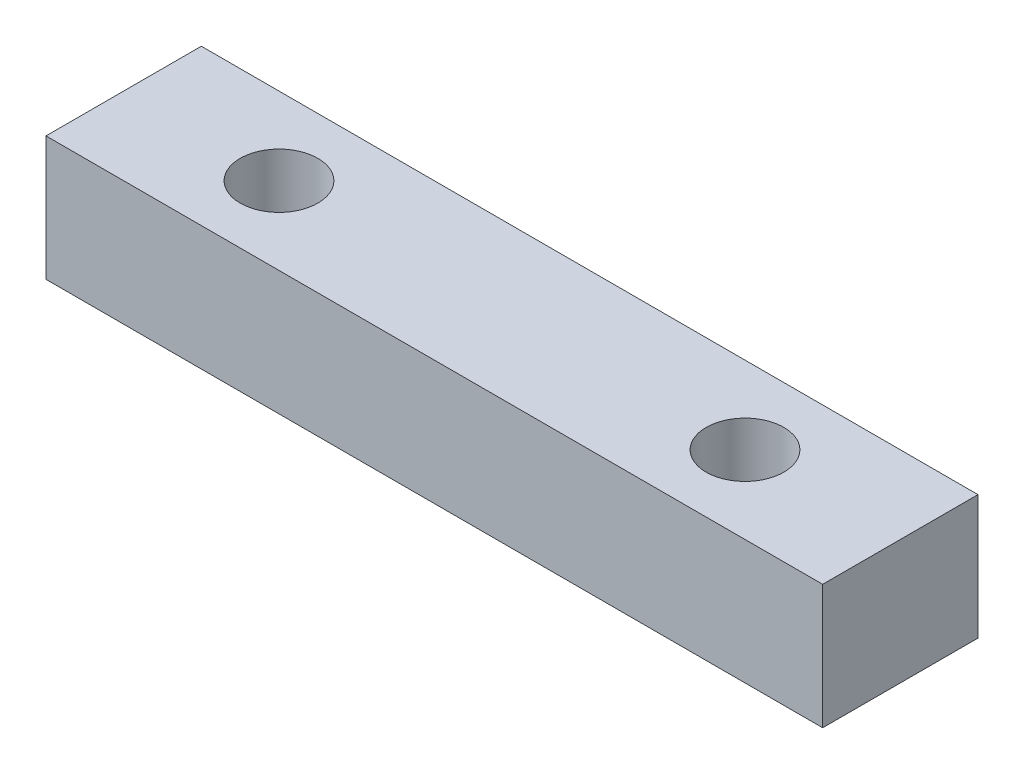
ISO-10303-21;
HEADER;
FILE_DESCRIPTION(('STEP AP214'),'2;1');
FILE_NAME('part.step','',(''),(''),'','','');
FILE_SCHEMA(('AUTOMOTIVE_DESIGN { 1 0 10303 214 1 1 1 1 }'));
ENDSEC;
DATA;
#1=APPLICATION_CONTEXT('core data for automotive mechanical design processes');
#2=APPLICATION_PROTOCOL_DEFINITION('international standard','automotive_design',2000,#1);
#3=PRODUCT_CONTEXT('',#1,'mechanical');
#4=PRODUCT('Part','Part','',(#3));
#5=PRODUCT_RELATED_PRODUCT_CATEGORY('part','',(#4));
#6=PRODUCT_DEFINITION_FORMATION('','',#4);
#7=PRODUCT_DEFINITION_CONTEXT('part definition',#1,'design');
#8=PRODUCT_DEFINITION('design','',#6,#7);
#9=PRODUCT_DEFINITION_SHAPE('','',#8);
#10=(LENGTH_UNIT() NAMED_UNIT(*) SI_UNIT(.MILLI.,.METRE.));
#11=(NAMED_UNIT(*) PLANE_ANGLE_UNIT() SI_UNIT($,.RADIAN.));
#12=(NAMED_UNIT(*) SI_UNIT($,.STERADIAN.) SOLID_ANGLE_UNIT());
#13=UNCERTAINTY_MEASURE_WITH_UNIT(LENGTH_MEASURE(1.E-05),#10,'distance_accuracy_value','');
#14=(GEOMETRIC_REPRESENTATION_CONTEXT(3) GLOBAL_UNCERTAINTY_ASSIGNED_CONTEXT((#13)) GLOBAL_UNIT_ASSIGNED_CONTEXT((#10,
#11,#12)) REPRESENTATION_CONTEXT('',''));
#15=CARTESIAN_POINT('',(0.,0.,0.));
#16=DIRECTION('',(0.,0.,1.));
#17=DIRECTION('',(1.,0.,0.));
#18=AXIS2_PLACEMENT_3D('',#15,#16,#17);
#19=CARTESIAN_POINT('',(0.,4.,0.));
#20=DIRECTION('',(0.,-1.,0.));
#21=DIRECTION('',(0.,0.,-1.));
#22=AXIS2_PLACEMENT_3D('',#19,#20,#21);
#23=PLANE('',#22);
#24=DIRECTION('',(0.,0.,-1.));
#25=VECTOR('',#24,1.);
#26=CARTESIAN_POINT('',(12.5,4.,-2.5));
#27=LINE('',#26,#25);
#28=CARTESIAN_POINT('',(12.5,4.,2.5));
#29=VERTEX_POINT('',#28);
#30=CARTESIAN_POINT('',(12.5,4.,-2.5));
#31=VERTEX_POINT('',#30);
#32=EDGE_CURVE('E85',#29,#31,#27,.T.);
#33=ORIENTED_EDGE('',*,*,#32,.T.);
#34=DIRECTION('',(-1.,0.,0.));
#35=VECTOR('',#34,1.);
#36=CARTESIAN_POINT('',(12.5,4.,-2.5));
#37=LINE('',#36,#35);
#38=CARTESIAN_POINT('',(-12.5,4.,-2.5));
#39=VERTEX_POINT('',#38);
#40=EDGE_CURVE('E80',#31,#39,#37,.T.);
#41=ORIENTED_EDGE('',*,*,#40,.T.);
#42=DIRECTION('',(0.,0.,1.));
#43=VECTOR('',#42,1.);
#44=CARTESIAN_POINT('',(-12.5,4.,-2.5));
#45=LINE('',#44,#43);
#46=CARTESIAN_POINT('',(-12.5,4.,2.5));
#47=VERTEX_POINT('',#46);
#48=EDGE_CURVE('E83',#39,#47,#45,.T.);
#49=ORIENTED_EDGE('',*,*,#48,.T.);
#50=DIRECTION('',(1.,0.,0.));
#51=VECTOR('',#50,1.);
#52=CARTESIAN_POINT('',(12.5,4.,2.5));
#53=LINE('',#52,#51);
#54=EDGE_CURVE('E50',#47,#29,#53,.T.);
#55=ORIENTED_EDGE('',*,*,#54,.T.);
#56=EDGE_LOOP('',(#33,#41,#49,#55));
#57=FACE_BOUND('',#56,.T.);
#58=CARTESIAN_POINT('',(7.5,4.,0.));
#59=DIRECTION('',(0.,1.,0.));
#60=DIRECTION('',(0.,0.,1.));
#61=AXIS2_PLACEMENT_3D('',#58,#59,#60);
#62=CIRCLE('',#61,1.25);
#63=CARTESIAN_POINT('',(7.5,4.,1.25));
#64=VERTEX_POINT('',#63);
#65=EDGE_CURVE('E100',#64,#64,#62,.T.);
#66=ORIENTED_EDGE('',*,*,#65,.F.);
#67=EDGE_LOOP('',(#66));
#68=FACE_BOUND('',#67,.T.);
#69=CARTESIAN_POINT('',(-7.5,4.,0.));
#70=DIRECTION('',(0.,1.,0.));
#71=DIRECTION('',(0.,0.,1.));
#72=AXIS2_PLACEMENT_3D('',#69,#70,#71);
#73=CIRCLE('',#72,1.25);
#74=CARTESIAN_POINT('',(-7.5,4.,1.25));
#75=VERTEX_POINT('',#74);
#76=EDGE_CURVE('E115',#75,#75,#73,.T.);
#77=ORIENTED_EDGE('',*,*,#76,.F.);
#78=EDGE_LOOP('',(#77));
#79=FACE_BOUND('',#78,.T.);
#80=ADVANCED_FACE('F33',(#57,#68,#79),#23,.F.);
#81=CARTESIAN_POINT('',(0.,0.,0.));
#82=DIRECTION('',(0.,-1.,0.));
#83=DIRECTION('',(0.,0.,-1.));
#84=AXIS2_PLACEMENT_3D('',#81,#82,#83);
#85=PLANE('',#84);
#86=CARTESIAN_POINT('',(7.5,0.,0.));
#87=DIRECTION('',(0.,1.,0.));
#88=DIRECTION('',(0.,0.,1.));
#89=AXIS2_PLACEMENT_3D('',#86,#87,#88);
#90=CIRCLE('',#89,1.25);
#91=CARTESIAN_POINT('',(7.5,0.,1.25));
#92=VERTEX_POINT('',#91);
#93=EDGE_CURVE('E112',#92,#92,#90,.T.);
#94=ORIENTED_EDGE('',*,*,#93,.T.);
#95=EDGE_LOOP('',(#94));
#96=FACE_BOUND('',#95,.T.);
#97=DIRECTION('',(0.,0.,-1.));
#98=VECTOR('',#97,1.);
#99=CARTESIAN_POINT('',(12.5,0.,-2.5));
#100=LINE('',#99,#98);
#101=CARTESIAN_POINT('',(12.5,0.,2.5));
#102=VERTEX_POINT('',#101);
#103=CARTESIAN_POINT('',(12.5,0.,-2.5));
#104=VERTEX_POINT('',#103);
#105=EDGE_CURVE('E97',#102,#104,#100,.T.);
#106=ORIENTED_EDGE('',*,*,#105,.F.);
#107=DIRECTION('',(1.,0.,0.));
#108=VECTOR('',#107,1.);
#109=CARTESIAN_POINT('',(12.5,0.,2.5));
#110=LINE('',#109,#108);
#111=CARTESIAN_POINT('',(-12.5,0.,2.5));
#112=VERTEX_POINT('',#111);
#113=EDGE_CURVE('E73',#112,#102,#110,.T.);
#114=ORIENTED_EDGE('',*,*,#113,.F.);
#115=DIRECTION('',(0.,0.,1.));
#116=VECTOR('',#115,1.);
#117=CARTESIAN_POINT('',(-12.5,0.,-2.5));
#118=LINE('',#117,#116);
#119=CARTESIAN_POINT('',(-12.5,0.,-2.5));
#120=VERTEX_POINT('',#119);
#121=EDGE_CURVE('E67',#120,#112,#118,.T.);
#122=ORIENTED_EDGE('',*,*,#121,.F.);
#123=DIRECTION('',(-1.,0.,0.));
#124=VECTOR('',#123,1.);
#125=CARTESIAN_POINT('',(12.5,0.,-2.5));
#126=LINE('',#125,#124);
#127=EDGE_CURVE('E89',#104,#120,#126,.T.);
#128=ORIENTED_EDGE('',*,*,#127,.F.);
#129=EDGE_LOOP('',(#106,#114,#122,#128));
#130=FACE_BOUND('',#129,.T.);
#131=CARTESIAN_POINT('',(-7.5,0.,0.));
#132=DIRECTION('',(0.,1.,0.));
#133=DIRECTION('',(0.,0.,1.));
#134=AXIS2_PLACEMENT_3D('',#131,#132,#133);
#135=CIRCLE('',#134,1.25);
#136=CARTESIAN_POINT('',(-7.5,0.,1.25));
#137=VERTEX_POINT('',#136);
#138=EDGE_CURVE('E118',#137,#137,#135,.T.);
#139=ORIENTED_EDGE('',*,*,#138,.T.);
#140=EDGE_LOOP('',(#139));
#141=FACE_BOUND('',#140,.T.);
#142=ADVANCED_FACE('F108',(#96,#130,#141),#85,.T.);
#143=CARTESIAN_POINT('',(12.5,4.,-2.5));
#144=DIRECTION('',(-1.,0.,0.));
#145=DIRECTION('',(0.,0.,1.));
#146=AXIS2_PLACEMENT_3D('',#143,#144,#145);
#147=PLANE('',#146);
#148=ORIENTED_EDGE('',*,*,#105,.T.);
#149=DIRECTION('',(0.,-1.,0.));
#150=VECTOR('',#149,1.);
#151=CARTESIAN_POINT('',(12.5,4.,-2.5));
#152=LINE('',#151,#150);
#153=EDGE_CURVE('E11',#31,#104,#152,.T.);
#154=ORIENTED_EDGE('',*,*,#153,.F.);
#155=ORIENTED_EDGE('',*,*,#32,.F.);
#156=DIRECTION('',(0.,-1.,0.));
#157=VECTOR('',#156,1.);
#158=CARTESIAN_POINT('',(12.5,4.,2.5));
#159=LINE('',#158,#157);
#160=EDGE_CURVE('E93',#29,#102,#159,.T.);
#161=ORIENTED_EDGE('',*,*,#160,.T.);
#162=EDGE_LOOP('',(#148,#154,#155,#161));
#163=FACE_BOUND('',#162,.T.);
#164=ADVANCED_FACE('F35',(#163),#147,.F.);
#165=CARTESIAN_POINT('',(12.5,4.,-2.5));
#166=DIRECTION('',(0.,0.,1.));
#167=DIRECTION('',(1.,0.,0.));
#168=AXIS2_PLACEMENT_3D('',#165,#166,#167);
#169=PLANE('',#168);
#170=ORIENTED_EDGE('',*,*,#127,.T.);
#171=DIRECTION('',(0.,-1.,0.));
#172=VECTOR('',#171,1.);
#173=CARTESIAN_POINT('',(-12.5,4.,-2.5));
#174=LINE('',#173,#172);
#175=EDGE_CURVE('E42',#39,#120,#174,.T.);
#176=ORIENTED_EDGE('',*,*,#175,.F.);
#177=ORIENTED_EDGE('',*,*,#40,.F.);
#178=ORIENTED_EDGE('',*,*,#153,.T.);
#179=EDGE_LOOP('',(#170,#176,#177,#178));
#180=FACE_BOUND('',#179,.T.);
#181=ADVANCED_FACE('F88',(#180),#169,.F.);
#182=CARTESIAN_POINT('',(-12.5,4.,-2.5));
#183=DIRECTION('',(1.,0.,0.));
#184=DIRECTION('',(0.,0.,-1.));
#185=AXIS2_PLACEMENT_3D('',#182,#183,#184);
#186=PLANE('',#185);
#187=ORIENTED_EDGE('',*,*,#121,.T.);
#188=DIRECTION('',(0.,-1.,0.));
#189=VECTOR('',#188,1.);
#190=CARTESIAN_POINT('',(-12.5,4.,2.5));
#191=LINE('',#190,#189);
#192=EDGE_CURVE('E90',#47,#112,#191,.T.);
#193=ORIENTED_EDGE('',*,*,#192,.F.);
#194=ORIENTED_EDGE('',*,*,#48,.F.);
#195=ORIENTED_EDGE('',*,*,#175,.T.);
#196=EDGE_LOOP('',(#187,#193,#194,#195));
#197=FACE_BOUND('',#196,.T.);
#198=ADVANCED_FACE('F91',(#197),#186,.F.);
#199=CARTESIAN_POINT('',(12.5,4.,2.5));
#200=DIRECTION('',(0.,0.,-1.));
#201=DIRECTION('',(-1.,0.,0.));
#202=AXIS2_PLACEMENT_3D('',#199,#200,#201);
#203=PLANE('',#202);
#204=ORIENTED_EDGE('',*,*,#113,.T.);
#205=ORIENTED_EDGE('',*,*,#160,.F.);
#206=ORIENTED_EDGE('',*,*,#54,.F.);
#207=ORIENTED_EDGE('',*,*,#192,.T.);
#208=EDGE_LOOP('',(#204,#205,#206,#207));
#209=FACE_BOUND('',#208,.T.);
#210=ADVANCED_FACE('F105',(#209),#203,.F.);
#211=CARTESIAN_POINT('',(7.5,4.,0.));
#212=DIRECTION('',(0.,-1.,0.));
#213=DIRECTION('',(0.,0.,-1.));
#214=AXIS2_PLACEMENT_3D('',#211,#212,#213);
#215=CYLINDRICAL_SURFACE('',#214,1.25);
#216=ORIENTED_EDGE('',*,*,#65,.T.);
#217=EDGE_LOOP('',(#216));
#218=FACE_BOUND('',#217,.T.);
#219=ORIENTED_EDGE('',*,*,#93,.F.);
#220=EDGE_LOOP('',(#219));
#221=FACE_BOUND('',#220,.T.);
#222=ADVANCED_FACE('F135',(#218,#221),#215,.F.);
#223=CARTESIAN_POINT('',(-7.5,4.,0.));
#224=DIRECTION('',(0.,-1.,0.));
#225=DIRECTION('',(0.,0.,-1.));
#226=AXIS2_PLACEMENT_3D('',#223,#224,#225);
#227=CYLINDRICAL_SURFACE('',#226,1.25);
#228=ORIENTED_EDGE('',*,*,#76,.T.);
#229=EDGE_LOOP('',(#228));
#230=FACE_BOUND('',#229,.T.);
#231=ORIENTED_EDGE('',*,*,#138,.F.);
#232=EDGE_LOOP('',(#231));
#233=FACE_BOUND('',#232,.T.);
#234=ADVANCED_FACE('F124',(#230,#233),#227,.F.);
#235=CLOSED_SHELL('',(#80,#142,#164,#181,#198,#210,#222,#234));
#236=MANIFOLD_SOLID_BREP('B2',#235);
#237=ADVANCED_BREP_SHAPE_REPRESENTATION('',(#18,#236),#14);
#238=SHAPE_DEFINITION_REPRESENTATION(#9,#237);
ENDSEC;
END-ISO-10303-21;
